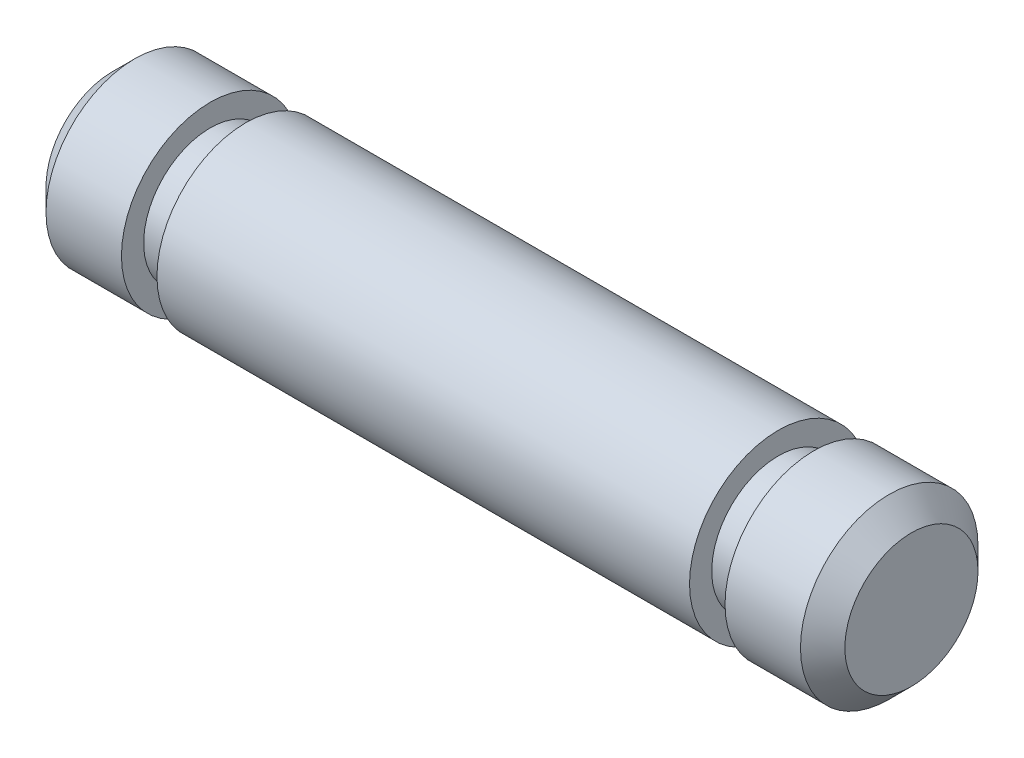
ISO-10303-21;
HEADER;
FILE_DESCRIPTION(('STEP AP214'),'2;1');
FILE_NAME('part.step','',(''),(''),'','','');
FILE_SCHEMA(('AUTOMOTIVE_DESIGN { 1 0 10303 214 1 1 1 1 }'));
ENDSEC;
DATA;
#1=APPLICATION_CONTEXT('core data for automotive mechanical design processes');
#2=APPLICATION_PROTOCOL_DEFINITION('international standard','automotive_design',2000,#1);
#3=PRODUCT_CONTEXT('',#1,'mechanical');
#4=PRODUCT('Part','Part','',(#3));
#5=PRODUCT_RELATED_PRODUCT_CATEGORY('part','',(#4));
#6=PRODUCT_DEFINITION_FORMATION('','',#4);
#7=PRODUCT_DEFINITION_CONTEXT('part definition',#1,'design');
#8=PRODUCT_DEFINITION('design','',#6,#7);
#9=PRODUCT_DEFINITION_SHAPE('','',#8);
#10=(LENGTH_UNIT() NAMED_UNIT(*) SI_UNIT(.MILLI.,.METRE.));
#11=(NAMED_UNIT(*) PLANE_ANGLE_UNIT() SI_UNIT($,.RADIAN.));
#12=(NAMED_UNIT(*) SI_UNIT($,.STERADIAN.) SOLID_ANGLE_UNIT());
#13=UNCERTAINTY_MEASURE_WITH_UNIT(LENGTH_MEASURE(1.E-05),#10,'distance_accuracy_value','');
#14=(GEOMETRIC_REPRESENTATION_CONTEXT(3) GLOBAL_UNCERTAINTY_ASSIGNED_CONTEXT((#13)) GLOBAL_UNIT_ASSIGNED_CONTEXT((#10,
#11,#12)) REPRESENTATION_CONTEXT('',''));
#15=CARTESIAN_POINT('',(0.,0.,0.));
#16=DIRECTION('',(0.,0.,1.));
#17=DIRECTION('',(1.,0.,0.));
#18=AXIS2_PLACEMENT_3D('',#15,#16,#17);
#19=CARTESIAN_POINT('',(9.,0.,0.));
#20=DIRECTION('',(-1.,0.,0.));
#21=DIRECTION('',(0.,0.,1.));
#22=AXIS2_PLACEMENT_3D('',#19,#20,#21);
#23=CYLINDRICAL_SURFACE('',#22,2.);
#24=CARTESIAN_POINT('',(6.,0.,0.));
#25=DIRECTION('',(1.,0.,0.));
#26=DIRECTION('',(0.,0.,-1.));
#27=AXIS2_PLACEMENT_3D('',#24,#25,#26);
#28=CIRCLE('',#27,2.);
#29=CARTESIAN_POINT('',(6.,0.,-2.));
#30=VERTEX_POINT('',#29);
#31=EDGE_CURVE('E62',#30,#30,#28,.T.);
#32=ORIENTED_EDGE('',*,*,#31,.F.);
#33=EDGE_LOOP('',(#32));
#34=FACE_BOUND('',#33,.T.);
#35=CARTESIAN_POINT('',(-6.,0.,0.));
#36=DIRECTION('',(1.,0.,0.));
#37=DIRECTION('',(0.,0.,-1.));
#38=AXIS2_PLACEMENT_3D('',#35,#36,#37);
#39=CIRCLE('',#38,2.);
#40=CARTESIAN_POINT('',(-6.,0.,-2.));
#41=VERTEX_POINT('',#40);
#42=EDGE_CURVE('E78',#41,#41,#39,.T.);
#43=ORIENTED_EDGE('',*,*,#42,.T.);
#44=EDGE_LOOP('',(#43));
#45=FACE_BOUND('',#44,.T.);
#46=ADVANCED_FACE('F37',(#34,#45),#23,.T.);
#47=CARTESIAN_POINT('',(6.8,0.,0.));
#48=DIRECTION('',(1.,0.,0.));
#49=DIRECTION('',(0.,0.,-1.));
#50=AXIS2_PLACEMENT_3D('',#47,#48,#49);
#51=CIRCLE('',#50,2.);
#52=CARTESIAN_POINT('',(6.8,0.,-2.));
#53=VERTEX_POINT('',#52);
#54=EDGE_CURVE('E61',#53,#53,#51,.T.);
#55=ORIENTED_EDGE('',*,*,#54,.T.);
#56=EDGE_LOOP('',(#55));
#57=FACE_BOUND('',#56,.T.);
#58=CARTESIAN_POINT('',(8.5,0.,0.));
#59=DIRECTION('',(1.,0.,0.));
#60=DIRECTION('',(0.,0.,-1.));
#61=AXIS2_PLACEMENT_3D('',#58,#59,#60);
#62=CIRCLE('',#61,2.);
#63=CARTESIAN_POINT('',(8.5,0.,-2.));
#64=VERTEX_POINT('',#63);
#65=EDGE_CURVE('E45',#64,#64,#62,.F.);
#66=ORIENTED_EDGE('',*,*,#65,.T.);
#67=EDGE_LOOP('',(#66));
#68=FACE_BOUND('',#67,.T.);
#69=ADVANCED_FACE('F109',(#57,#68),#23,.T.);
#70=CARTESIAN_POINT('',(9.,0.,0.));
#71=DIRECTION('',(1.,0.,0.));
#72=DIRECTION('',(0.,0.,-1.));
#73=AXIS2_PLACEMENT_3D('',#70,#71,#72);
#74=PLANE('',#73);
#75=CARTESIAN_POINT('',(9.,0.,0.));
#76=DIRECTION('',(1.,0.,0.));
#77=DIRECTION('',(0.,0.,-1.));
#78=AXIS2_PLACEMENT_3D('',#75,#76,#77);
#79=CIRCLE('',#78,1.5);
#80=CARTESIAN_POINT('',(9.,0.,-1.5));
#81=VERTEX_POINT('',#80);
#82=EDGE_CURVE('E55',#81,#81,#79,.T.);
#83=ORIENTED_EDGE('',*,*,#82,.T.);
#84=EDGE_LOOP('',(#83));
#85=FACE_BOUND('',#84,.T.);
#86=ADVANCED_FACE('F124',(#85),#74,.T.);
#87=CARTESIAN_POINT('',(9.,0.,0.));
#88=DIRECTION('',(-1.,0.,0.));
#89=DIRECTION('',(0.,0.,1.));
#90=AXIS2_PLACEMENT_3D('',#87,#88,#89);
#91=CONICAL_SURFACE('',#90,1.5,0.785398163397447);
#92=ORIENTED_EDGE('',*,*,#65,.F.);
#93=EDGE_LOOP('',(#92));
#94=FACE_BOUND('',#93,.T.);
#95=ORIENTED_EDGE('',*,*,#82,.F.);
#96=EDGE_LOOP('',(#95));
#97=FACE_BOUND('',#96,.T.);
#98=ADVANCED_FACE('F129',(#94,#97),#91,.T.);
#99=CARTESIAN_POINT('',(6.8,0.,0.));
#100=DIRECTION('',(1.,0.,0.));
#101=DIRECTION('',(0.,0.,-1.));
#102=AXIS2_PLACEMENT_3D('',#99,#100,#101);
#103=PLANE('',#102);
#104=ORIENTED_EDGE('',*,*,#54,.F.);
#105=EDGE_LOOP('',(#104));
#106=FACE_BOUND('',#105,.T.);
#107=CARTESIAN_POINT('',(6.8,0.,0.));
#108=DIRECTION('',(1.,0.,0.));
#109=DIRECTION('',(0.,0.,-1.));
#110=AXIS2_PLACEMENT_3D('',#107,#108,#109);
#111=CIRCLE('',#110,1.5);
#112=CARTESIAN_POINT('',(6.8,0.,-1.5));
#113=VERTEX_POINT('',#112);
#114=EDGE_CURVE('E66',#113,#113,#111,.T.);
#115=ORIENTED_EDGE('',*,*,#114,.T.);
#116=EDGE_LOOP('',(#115));
#117=FACE_BOUND('',#116,.T.);
#118=ADVANCED_FACE('F131',(#106,#117),#103,.F.);
#119=CARTESIAN_POINT('',(6.,0.,0.));
#120=DIRECTION('',(1.,0.,0.));
#121=DIRECTION('',(0.,0.,-1.));
#122=AXIS2_PLACEMENT_3D('',#119,#120,#121);
#123=PLANE('',#122);
#124=ORIENTED_EDGE('',*,*,#31,.T.);
#125=EDGE_LOOP('',(#124));
#126=FACE_BOUND('',#125,.T.);
#127=CARTESIAN_POINT('',(6.,0.,0.));
#128=DIRECTION('',(1.,0.,0.));
#129=DIRECTION('',(0.,0.,-1.));
#130=AXIS2_PLACEMENT_3D('',#127,#128,#129);
#131=CIRCLE('',#130,1.5);
#132=CARTESIAN_POINT('',(6.,0.,-1.5));
#133=VERTEX_POINT('',#132);
#134=EDGE_CURVE('E70',#133,#133,#131,.T.);
#135=ORIENTED_EDGE('',*,*,#134,.F.);
#136=EDGE_LOOP('',(#135));
#137=FACE_BOUND('',#136,.T.);
#138=ADVANCED_FACE('F137',(#126,#137),#123,.T.);
#139=CARTESIAN_POINT('',(6.8,0.,0.));
#140=DIRECTION('',(-1.,0.,0.));
#141=DIRECTION('',(0.,0.,1.));
#142=AXIS2_PLACEMENT_3D('',#139,#140,#141);
#143=CYLINDRICAL_SURFACE('',#142,1.5);
#144=ORIENTED_EDGE('',*,*,#114,.F.);
#145=EDGE_LOOP('',(#144));
#146=FACE_BOUND('',#145,.T.);
#147=ORIENTED_EDGE('',*,*,#134,.T.);
#148=EDGE_LOOP('',(#147));
#149=FACE_BOUND('',#148,.T.);
#150=ADVANCED_FACE('F101',(#146,#149),#143,.T.);
#151=CARTESIAN_POINT('',(-6.8,0.,0.));
#152=DIRECTION('',(-1.,0.,0.));
#153=DIRECTION('',(0.,0.,-1.));
#154=AXIS2_PLACEMENT_3D('',#151,#152,#153);
#155=PLANE('',#154);
#156=CARTESIAN_POINT('',(-6.8,0.,0.));
#157=DIRECTION('',(1.,0.,0.));
#158=DIRECTION('',(0.,0.,-1.));
#159=AXIS2_PLACEMENT_3D('',#156,#157,#158);
#160=CIRCLE('',#159,1.5);
#161=CARTESIAN_POINT('',(-6.8,0.,-1.5));
#162=VERTEX_POINT('',#161);
#163=EDGE_CURVE('E82',#162,#162,#160,.T.);
#164=ORIENTED_EDGE('',*,*,#163,.F.);
#165=EDGE_LOOP('',(#164));
#166=FACE_BOUND('',#165,.T.);
#167=CARTESIAN_POINT('',(-6.8,0.,0.));
#168=DIRECTION('',(1.,0.,0.));
#169=DIRECTION('',(0.,0.,-1.));
#170=AXIS2_PLACEMENT_3D('',#167,#168,#169);
#171=CIRCLE('',#170,2.);
#172=CARTESIAN_POINT('',(-6.8,0.,-2.));
#173=VERTEX_POINT('',#172);
#174=EDGE_CURVE('E74',#173,#173,#171,.T.);
#175=ORIENTED_EDGE('',*,*,#174,.T.);
#176=EDGE_LOOP('',(#175));
#177=FACE_BOUND('',#176,.T.);
#178=ADVANCED_FACE('F97',(#166,#177),#155,.F.);
#179=CARTESIAN_POINT('',(-6.,0.,0.));
#180=DIRECTION('',(-1.,0.,0.));
#181=DIRECTION('',(0.,0.,-1.));
#182=AXIS2_PLACEMENT_3D('',#179,#180,#181);
#183=PLANE('',#182);
#184=CARTESIAN_POINT('',(-6.,0.,0.));
#185=DIRECTION('',(1.,0.,0.));
#186=DIRECTION('',(0.,0.,-1.));
#187=AXIS2_PLACEMENT_3D('',#184,#185,#186);
#188=CIRCLE('',#187,1.5);
#189=CARTESIAN_POINT('',(-6.,0.,-1.5));
#190=VERTEX_POINT('',#189);
#191=EDGE_CURVE('E86',#190,#190,#188,.T.);
#192=ORIENTED_EDGE('',*,*,#191,.T.);
#193=EDGE_LOOP('',(#192));
#194=FACE_BOUND('',#193,.T.);
#195=ORIENTED_EDGE('',*,*,#42,.F.);
#196=EDGE_LOOP('',(#195));
#197=FACE_BOUND('',#196,.T.);
#198=ADVANCED_FACE('F100',(#194,#197),#183,.T.);
#199=CARTESIAN_POINT('',(-6.8,0.,0.));
#200=DIRECTION('',(1.,0.,0.));
#201=DIRECTION('',(0.,0.,-1.));
#202=AXIS2_PLACEMENT_3D('',#199,#200,#201);
#203=CYLINDRICAL_SURFACE('',#202,1.5);
#204=ORIENTED_EDGE('',*,*,#163,.T.);
#205=EDGE_LOOP('',(#204));
#206=FACE_BOUND('',#205,.T.);
#207=ORIENTED_EDGE('',*,*,#191,.F.);
#208=EDGE_LOOP('',(#207));
#209=FACE_BOUND('',#208,.T.);
#210=ADVANCED_FACE('F94',(#206,#209),#203,.T.);
#211=CARTESIAN_POINT('',(-9.,0.,0.));
#212=DIRECTION('',(1.,0.,0.));
#213=DIRECTION('',(0.,0.,-1.));
#214=AXIS2_PLACEMENT_3D('',#211,#212,#213);
#215=PLANE('',#214);
#216=CARTESIAN_POINT('',(-9.,0.,0.));
#217=DIRECTION('',(1.,0.,0.));
#218=DIRECTION('',(0.,0.,-1.));
#219=AXIS2_PLACEMENT_3D('',#216,#217,#218);
#220=CIRCLE('',#219,1.49999999999999);
#221=CARTESIAN_POINT('',(-9.,0.,-1.49999999999999));
#222=VERTEX_POINT('',#221);
#223=EDGE_CURVE('E10',#222,#222,#220,.F.);
#224=ORIENTED_EDGE('',*,*,#223,.T.);
#225=EDGE_LOOP('',(#224));
#226=FACE_BOUND('',#225,.T.);
#227=ADVANCED_FACE('F113',(#226),#215,.F.);
#228=CARTESIAN_POINT('',(-8.49999999999999,0.,0.));
#229=DIRECTION('',(1.,0.,0.));
#230=DIRECTION('',(0.,0.,-1.));
#231=AXIS2_PLACEMENT_3D('',#228,#229,#230);
#232=CONICAL_SURFACE('',#231,2.,0.785398163397447);
#233=ORIENTED_EDGE('',*,*,#223,.F.);
#234=EDGE_LOOP('',(#233));
#235=FACE_BOUND('',#234,.T.);
#236=CARTESIAN_POINT('',(-8.49999999999999,0.,0.));
#237=DIRECTION('',(1.,0.,0.));
#238=DIRECTION('',(0.,0.,-1.));
#239=AXIS2_PLACEMENT_3D('',#236,#237,#238);
#240=CIRCLE('',#239,2.);
#241=CARTESIAN_POINT('',(-8.49999999999999,0.,-2.));
#242=VERTEX_POINT('',#241);
#243=EDGE_CURVE('E50',#242,#242,#240,.T.);
#244=ORIENTED_EDGE('',*,*,#243,.F.);
#245=EDGE_LOOP('',(#244));
#246=FACE_BOUND('',#245,.T.);
#247=ADVANCED_FACE('F39',(#235,#246),#232,.T.);
#248=ORIENTED_EDGE('',*,*,#174,.F.);
#249=EDGE_LOOP('',(#248));
#250=FACE_BOUND('',#249,.T.);
#251=ORIENTED_EDGE('',*,*,#243,.T.);
#252=EDGE_LOOP('',(#251));
#253=FACE_BOUND('',#252,.T.);
#254=ADVANCED_FACE('F105',(#250,#253),#23,.T.);
#255=CLOSED_SHELL('',(#46,#69,#86,#98,#118,#138,#150,#178,#198,#210,#227,#247,#254));
#256=MANIFOLD_SOLID_BREP('B2',#255);
#257=ADVANCED_BREP_SHAPE_REPRESENTATION('',(#18,#256),#14);
#258=SHAPE_DEFINITION_REPRESENTATION(#9,#257);
ENDSEC;
END-ISO-10303-21;
